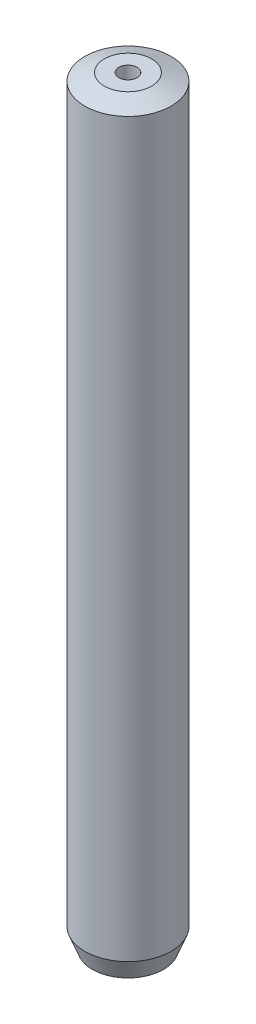
ISO-10303-21;
HEADER;
FILE_DESCRIPTION(('STEP AP214'),'2;1');
FILE_NAME('part.step','',(''),(''),'','','');
FILE_SCHEMA(('AUTOMOTIVE_DESIGN { 1 0 10303 214 1 1 1 1 }'));
ENDSEC;
DATA;
#1=APPLICATION_CONTEXT('core data for automotive mechanical design processes');
#2=APPLICATION_PROTOCOL_DEFINITION('international standard','automotive_design',2000,#1);
#3=PRODUCT_CONTEXT('',#1,'mechanical');
#4=PRODUCT('Part','Part','',(#3));
#5=PRODUCT_RELATED_PRODUCT_CATEGORY('part','',(#4));
#6=PRODUCT_DEFINITION_FORMATION('','',#4);
#7=PRODUCT_DEFINITION_CONTEXT('part definition',#1,'design');
#8=PRODUCT_DEFINITION('design','',#6,#7);
#9=PRODUCT_DEFINITION_SHAPE('','',#8);
#10=(LENGTH_UNIT() NAMED_UNIT(*) SI_UNIT(.MILLI.,.METRE.));
#11=(NAMED_UNIT(*) PLANE_ANGLE_UNIT() SI_UNIT($,.RADIAN.));
#12=(NAMED_UNIT(*) SI_UNIT($,.STERADIAN.) SOLID_ANGLE_UNIT());
#13=UNCERTAINTY_MEASURE_WITH_UNIT(LENGTH_MEASURE(1.E-05),#10,'distance_accuracy_value','');
#14=(GEOMETRIC_REPRESENTATION_CONTEXT(3) GLOBAL_UNCERTAINTY_ASSIGNED_CONTEXT((#13)) GLOBAL_UNIT_ASSIGNED_CONTEXT((#10,
#11,#12)) REPRESENTATION_CONTEXT('',''));
#15=CARTESIAN_POINT('',(0.,0.,0.));
#16=DIRECTION('',(0.,0.,1.));
#17=DIRECTION('',(1.,0.,0.));
#18=AXIS2_PLACEMENT_3D('',#15,#16,#17);
#19=CARTESIAN_POINT('',(0.,87.9561111005891,0.));
#20=DIRECTION('',(0.,-1.,0.));
#21=DIRECTION('',(0.,0.,-1.));
#22=AXIS2_PLACEMENT_3D('',#19,#20,#21);
#23=CYLINDRICAL_SURFACE('',#22,5.);
#24=CARTESIAN_POINT('',(0.,87.0790477124236,0.));
#25=DIRECTION('',(0.,1.,0.));
#26=DIRECTION('',(0.,0.,1.));
#27=AXIS2_PLACEMENT_3D('',#24,#25,#26);
#28=CIRCLE('',#27,5.);
#29=CARTESIAN_POINT('',(0.,87.0790477124236,5.));
#30=VERTEX_POINT('',#29);
#31=EDGE_CURVE('E50',#30,#30,#28,.F.);
#32=ORIENTED_EDGE('',*,*,#31,.T.);
#33=EDGE_LOOP('',(#32));
#34=FACE_BOUND('',#33,.T.);
#35=CARTESIAN_POINT('',(0.,2.26026541588316,0.));
#36=DIRECTION('',(0.,1.,0.));
#37=DIRECTION('',(0.,0.,1.));
#38=AXIS2_PLACEMENT_3D('',#35,#36,#37);
#39=CIRCLE('',#38,5.);
#40=CARTESIAN_POINT('',(0.,2.26026541588316,5.));
#41=VERTEX_POINT('',#40);
#42=EDGE_CURVE('E51',#41,#41,#39,.T.);
#43=ORIENTED_EDGE('',*,*,#42,.T.);
#44=EDGE_LOOP('',(#43));
#45=FACE_BOUND('',#44,.T.);
#46=ADVANCED_FACE('F39',(#34,#45),#23,.T.);
#47=CARTESIAN_POINT('',(0.,87.9561111005891,0.));
#48=DIRECTION('',(0.,1.,0.));
#49=DIRECTION('',(0.,0.,1.));
#50=AXIS2_PLACEMENT_3D('',#47,#48,#49);
#51=PLANE('',#50);
#52=CARTESIAN_POINT('',(0.,87.9561111005891,0.));
#53=DIRECTION('',(0.,1.,0.));
#54=DIRECTION('',(0.,0.,1.));
#55=AXIS2_PLACEMENT_3D('',#52,#53,#54);
#56=CIRCLE('',#55,2.73973458411683);
#57=CARTESIAN_POINT('',(0.,87.9561111005891,2.73973458411683));
#58=VERTEX_POINT('',#57);
#59=EDGE_CURVE('E54',#58,#58,#56,.T.);
#60=ORIENTED_EDGE('',*,*,#59,.T.);
#61=EDGE_LOOP('',(#60));
#62=FACE_BOUND('',#61,.T.);
#63=CARTESIAN_POINT('',(0.,87.9561111005891,0.));
#64=DIRECTION('',(0.,1.,0.));
#65=DIRECTION('',(0.,0.,1.));
#66=AXIS2_PLACEMENT_3D('',#63,#64,#65);
#67=CIRCLE('',#66,1.05046119070904);
#68=CARTESIAN_POINT('',(0.,87.9561111005891,1.05046119070904));
#69=VERTEX_POINT('',#68);
#70=EDGE_CURVE('E58',#69,#69,#67,.T.);
#71=ORIENTED_EDGE('',*,*,#70,.F.);
#72=EDGE_LOOP('',(#71));
#73=FACE_BOUND('',#72,.T.);
#74=ADVANCED_FACE('F69',(#62,#73),#51,.T.);
#75=CARTESIAN_POINT('',(0.,0.,0.));
#76=DIRECTION('',(0.,1.,0.));
#77=DIRECTION('',(0.,0.,1.));
#78=AXIS2_PLACEMENT_3D('',#75,#76,#77);
#79=PLANE('',#78);
#80=CARTESIAN_POINT('',(0.,0.,0.));
#81=DIRECTION('',(0.,1.,0.));
#82=DIRECTION('',(0.,0.,1.));
#83=AXIS2_PLACEMENT_3D('',#80,#81,#82);
#84=CIRCLE('',#83,4.12293661183449);
#85=CARTESIAN_POINT('',(0.,0.,4.12293661183449));
#86=VERTEX_POINT('',#85);
#87=EDGE_CURVE('E10',#86,#86,#84,.F.);
#88=ORIENTED_EDGE('',*,*,#87,.T.);
#89=EDGE_LOOP('',(#88));
#90=FACE_BOUND('',#89,.T.);
#91=CARTESIAN_POINT('',(0.,0.,0.));
#92=DIRECTION('',(0.,1.,0.));
#93=DIRECTION('',(0.,0.,1.));
#94=AXIS2_PLACEMENT_3D('',#91,#92,#93);
#95=CIRCLE('',#94,1.05046119070904);
#96=CARTESIAN_POINT('',(0.,0.,1.05046119070904));
#97=VERTEX_POINT('',#96);
#98=EDGE_CURVE('E63',#97,#97,#95,.T.);
#99=ORIENTED_EDGE('',*,*,#98,.T.);
#100=EDGE_LOOP('',(#99));
#101=FACE_BOUND('',#100,.T.);
#102=ADVANCED_FACE('F75',(#90,#101),#79,.F.);
#103=CARTESIAN_POINT('',(0.,87.9561111005891,0.));
#104=DIRECTION('',(0.,-1.,0.));
#105=DIRECTION('',(0.,0.,-1.));
#106=AXIS2_PLACEMENT_3D('',#103,#104,#105);
#107=CYLINDRICAL_SURFACE('',#106,1.05046119070904);
#108=ORIENTED_EDGE('',*,*,#70,.T.);
#109=EDGE_LOOP('',(#108));
#110=FACE_BOUND('',#109,.T.);
#111=ORIENTED_EDGE('',*,*,#98,.F.);
#112=EDGE_LOOP('',(#111));
#113=FACE_BOUND('',#112,.T.);
#114=ADVANCED_FACE('F70',(#110,#113),#107,.F.);
#115=CARTESIAN_POINT('',(0.,87.9561111005891,0.));
#116=DIRECTION('',(0.,-1.,0.));
#117=DIRECTION('',(0.,0.,-1.));
#118=AXIS2_PLACEMENT_3D('',#115,#116,#117);
#119=CONICAL_SURFACE('',#118,2.73973458411683,1.2006464687407);
#120=ORIENTED_EDGE('',*,*,#31,.F.);
#121=EDGE_LOOP('',(#120));
#122=FACE_BOUND('',#121,.T.);
#123=ORIENTED_EDGE('',*,*,#59,.F.);
#124=EDGE_LOOP('',(#123));
#125=FACE_BOUND('',#124,.T.);
#126=ADVANCED_FACE('F81',(#122,#125),#119,.T.);
#127=CARTESIAN_POINT('',(0.,2.26026541588316,0.));
#128=DIRECTION('',(0.,1.,0.));
#129=DIRECTION('',(0.,0.,1.));
#130=AXIS2_PLACEMENT_3D('',#127,#128,#129);
#131=CONICAL_SURFACE('',#130,5.,0.370149858054193);
#132=ORIENTED_EDGE('',*,*,#87,.F.);
#133=EDGE_LOOP('',(#132));
#134=FACE_BOUND('',#133,.T.);
#135=ORIENTED_EDGE('',*,*,#42,.F.);
#136=EDGE_LOOP('',(#135));
#137=FACE_BOUND('',#136,.T.);
#138=ADVANCED_FACE('F45',(#134,#137),#131,.T.);
#139=CLOSED_SHELL('',(#46,#74,#102,#114,#126,#138));
#140=MANIFOLD_SOLID_BREP('B2',#139);
#141=ADVANCED_BREP_SHAPE_REPRESENTATION('',(#18,#140),#14);
#142=SHAPE_DEFINITION_REPRESENTATION(#9,#141);
ENDSEC;
END-ISO-10303-21;
